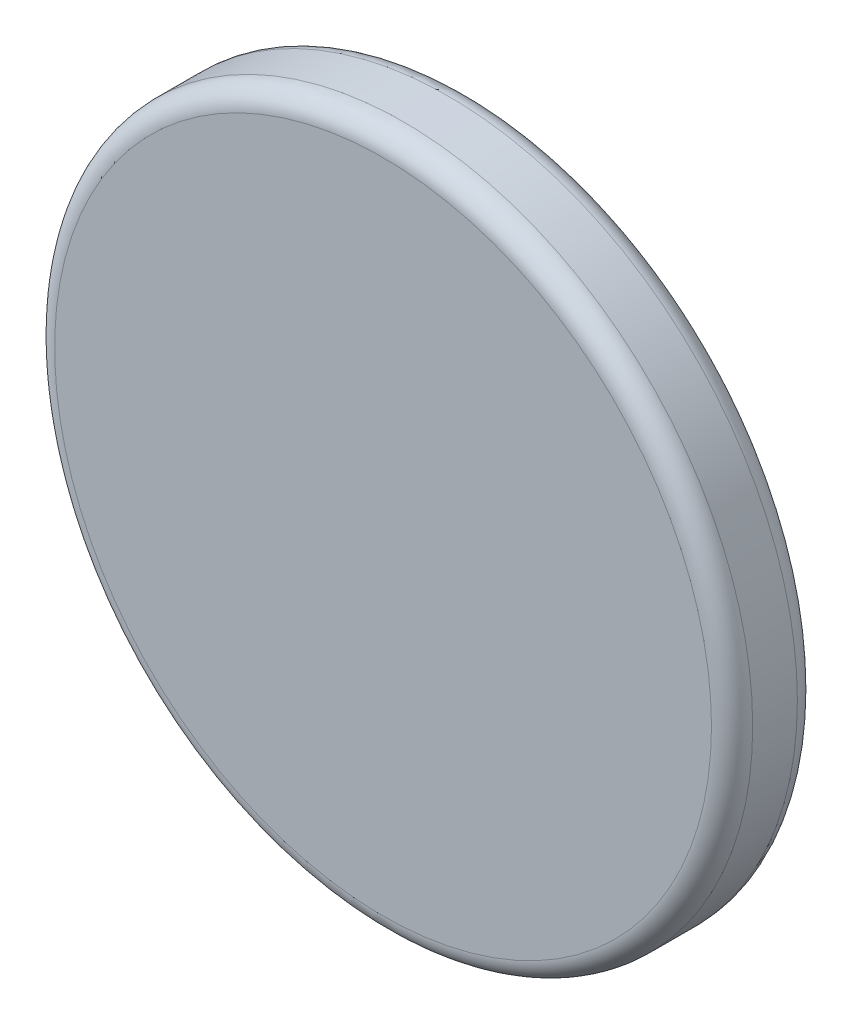
ISO-10303-21;
HEADER;
FILE_DESCRIPTION(('STEP AP214'),'2;1');
FILE_NAME('part.step','',(''),(''),'','','');
FILE_SCHEMA(('AUTOMOTIVE_DESIGN { 1 0 10303 214 1 1 1 1 }'));
ENDSEC;
DATA;
#1=APPLICATION_CONTEXT('core data for automotive mechanical design processes');
#2=APPLICATION_PROTOCOL_DEFINITION('international standard','automotive_design',2000,#1);
#3=PRODUCT_CONTEXT('',#1,'mechanical');
#4=PRODUCT('Part','Part','',(#3));
#5=PRODUCT_RELATED_PRODUCT_CATEGORY('part','',(#4));
#6=PRODUCT_DEFINITION_FORMATION('','',#4);
#7=PRODUCT_DEFINITION_CONTEXT('part definition',#1,'design');
#8=PRODUCT_DEFINITION('design','',#6,#7);
#9=PRODUCT_DEFINITION_SHAPE('','',#8);
#10=(LENGTH_UNIT() NAMED_UNIT(*) SI_UNIT(.MILLI.,.METRE.));
#11=(NAMED_UNIT(*) PLANE_ANGLE_UNIT() SI_UNIT($,.RADIAN.));
#12=(NAMED_UNIT(*) SI_UNIT($,.STERADIAN.) SOLID_ANGLE_UNIT());
#13=UNCERTAINTY_MEASURE_WITH_UNIT(LENGTH_MEASURE(1.E-05),#10,'distance_accuracy_value','');
#14=(GEOMETRIC_REPRESENTATION_CONTEXT(3) GLOBAL_UNCERTAINTY_ASSIGNED_CONTEXT((#13)) GLOBAL_UNIT_ASSIGNED_CONTEXT((#10,
#11,#12)) REPRESENTATION_CONTEXT('',''));
#15=CARTESIAN_POINT('',(0.,0.,0.));
#16=DIRECTION('',(0.,0.,1.));
#17=DIRECTION('',(1.,0.,0.));
#18=AXIS2_PLACEMENT_3D('',#15,#16,#17);
#19=CARTESIAN_POINT('',(0.,0.,25.));
#20=DIRECTION('',(0.,0.,-1.));
#21=DIRECTION('',(-1.,0.,0.));
#22=AXIS2_PLACEMENT_3D('',#19,#20,#21);
#23=CYLINDRICAL_SURFACE('',#22,203.2);
#24=CARTESIAN_POINT('',(0.,0.,-13.));
#25=DIRECTION('',(0.,0.,1.));
#26=DIRECTION('',(1.,0.,0.));
#27=AXIS2_PLACEMENT_3D('',#24,#25,#26);
#28=CIRCLE('',#27,203.2);
#29=CARTESIAN_POINT('',(203.2,0.,-13.));
#30=VERTEX_POINT('',#29);
#31=EDGE_CURVE('E46',#30,#30,#28,.T.);
#32=ORIENTED_EDGE('',*,*,#31,.T.);
#33=EDGE_LOOP('',(#32));
#34=FACE_BOUND('',#33,.T.);
#35=CARTESIAN_POINT('',(0.,0.,13.));
#36=DIRECTION('',(0.,0.,1.));
#37=DIRECTION('',(1.,0.,0.));
#38=AXIS2_PLACEMENT_3D('',#35,#36,#37);
#39=CIRCLE('',#38,203.2);
#40=CARTESIAN_POINT('',(203.2,0.,13.));
#41=VERTEX_POINT('',#40);
#42=EDGE_CURVE('E50',#41,#41,#39,.F.);
#43=ORIENTED_EDGE('',*,*,#42,.T.);
#44=EDGE_LOOP('',(#43));
#45=FACE_BOUND('',#44,.T.);
#46=ADVANCED_FACE('F35',(#34,#45),#23,.T.);
#47=CARTESIAN_POINT('',(0.,0.,25.));
#48=DIRECTION('',(0.,0.,1.));
#49=DIRECTION('',(1.,0.,0.));
#50=AXIS2_PLACEMENT_3D('',#47,#48,#49);
#51=PLANE('',#50);
#52=CARTESIAN_POINT('',(0.,0.,25.));
#53=DIRECTION('',(0.,0.,1.));
#54=DIRECTION('',(1.,0.,0.));
#55=AXIS2_PLACEMENT_3D('',#52,#53,#54);
#56=CIRCLE('',#55,191.2);
#57=CARTESIAN_POINT('',(191.2,0.,25.));
#58=VERTEX_POINT('',#57);
#59=EDGE_CURVE('E10',#58,#58,#56,.T.);
#60=ORIENTED_EDGE('',*,*,#59,.T.);
#61=EDGE_LOOP('',(#60));
#62=FACE_BOUND('',#61,.T.);
#63=ADVANCED_FACE('F66',(#62),#51,.T.);
#64=CARTESIAN_POINT('',(0.,0.,-25.));
#65=DIRECTION('',(0.,0.,1.));
#66=DIRECTION('',(1.,0.,0.));
#67=AXIS2_PLACEMENT_3D('',#64,#65,#66);
#68=PLANE('',#67);
#69=CARTESIAN_POINT('',(0.,0.,-25.));
#70=DIRECTION('',(0.,0.,1.));
#71=DIRECTION('',(1.,0.,0.));
#72=AXIS2_PLACEMENT_3D('',#69,#70,#71);
#73=CIRCLE('',#72,191.2);
#74=CARTESIAN_POINT('',(191.2,0.,-25.));
#75=VERTEX_POINT('',#74);
#76=EDGE_CURVE('E42',#75,#75,#73,.F.);
#77=ORIENTED_EDGE('',*,*,#76,.T.);
#78=EDGE_LOOP('',(#77));
#79=FACE_BOUND('',#78,.T.);
#80=ADVANCED_FACE('F63',(#79),#68,.F.);
#81=CARTESIAN_POINT('',(0.,0.,-13.));
#82=DIRECTION('',(0.,0.,1.));
#83=DIRECTION('',(1.,0.,0.));
#84=AXIS2_PLACEMENT_3D('',#81,#82,#83);
#85=TOROIDAL_SURFACE('',#84,191.2,12.);
#86=ORIENTED_EDGE('',*,*,#76,.F.);
#87=EDGE_LOOP('',(#86));
#88=FACE_BOUND('',#87,.T.);
#89=ORIENTED_EDGE('',*,*,#31,.F.);
#90=EDGE_LOOP('',(#89));
#91=FACE_BOUND('',#90,.T.);
#92=ADVANCED_FACE('F59',(#88,#91),#85,.T.);
#93=CARTESIAN_POINT('',(0.,0.,13.));
#94=DIRECTION('',(0.,0.,1.));
#95=DIRECTION('',(1.,0.,0.));
#96=AXIS2_PLACEMENT_3D('',#93,#94,#95);
#97=TOROIDAL_SURFACE('',#96,191.2,12.);
#98=ORIENTED_EDGE('',*,*,#42,.F.);
#99=EDGE_LOOP('',(#98));
#100=FACE_BOUND('',#99,.T.);
#101=ORIENTED_EDGE('',*,*,#59,.F.);
#102=EDGE_LOOP('',(#101));
#103=FACE_BOUND('',#102,.T.);
#104=ADVANCED_FACE('F37',(#100,#103),#97,.T.);
#105=CLOSED_SHELL('',(#46,#63,#80,#92,#104));
#106=MANIFOLD_SOLID_BREP('B2',#105);
#107=ADVANCED_BREP_SHAPE_REPRESENTATION('',(#18,#106),#14);
#108=SHAPE_DEFINITION_REPRESENTATION(#9,#107);
ENDSEC;
END-ISO-10303-21;
